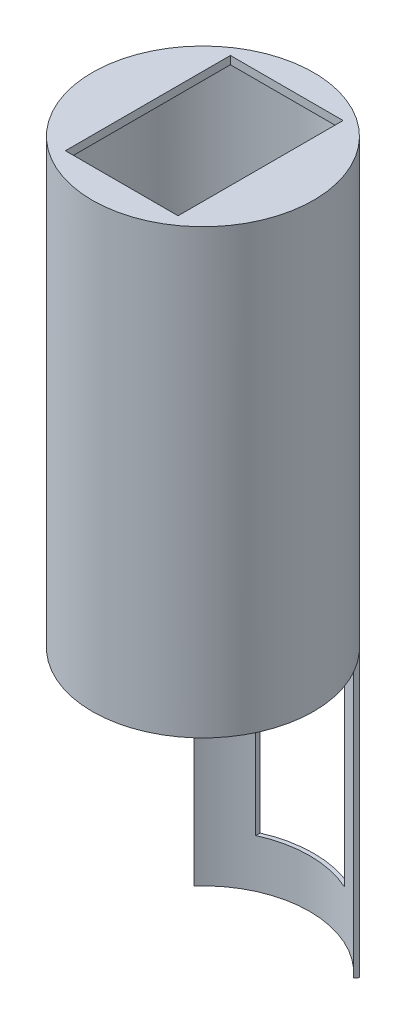
ISO-10303-21;
HEADER;
FILE_DESCRIPTION(('STEP AP214'),'2;1');
FILE_NAME('part.step','',(''),(''),'','','');
FILE_SCHEMA(('AUTOMOTIVE_DESIGN { 1 0 10303 214 1 1 1 1 }'));
ENDSEC;
DATA;
#1=APPLICATION_CONTEXT('core data for automotive mechanical design processes');
#2=APPLICATION_PROTOCOL_DEFINITION('international standard','automotive_design',2000,#1);
#3=PRODUCT_CONTEXT('',#1,'mechanical');
#4=PRODUCT('Part','Part','',(#3));
#5=PRODUCT_RELATED_PRODUCT_CATEGORY('part','',(#4));
#6=PRODUCT_DEFINITION_FORMATION('','',#4);
#7=PRODUCT_DEFINITION_CONTEXT('part definition',#1,'design');
#8=PRODUCT_DEFINITION('design','',#6,#7);
#9=PRODUCT_DEFINITION_SHAPE('','',#8);
#10=(LENGTH_UNIT() NAMED_UNIT(*) SI_UNIT(.MILLI.,.METRE.));
#11=(NAMED_UNIT(*) PLANE_ANGLE_UNIT() SI_UNIT($,.RADIAN.));
#12=(NAMED_UNIT(*) SI_UNIT($,.STERADIAN.) SOLID_ANGLE_UNIT());
#13=UNCERTAINTY_MEASURE_WITH_UNIT(LENGTH_MEASURE(1.E-05),#10,'distance_accuracy_value','');
#14=(GEOMETRIC_REPRESENTATION_CONTEXT(3) GLOBAL_UNCERTAINTY_ASSIGNED_CONTEXT((#13)) GLOBAL_UNIT_ASSIGNED_CONTEXT((#10,
#11,#12)) REPRESENTATION_CONTEXT('',''));
#15=CARTESIAN_POINT('',(0.,0.,0.));
#16=DIRECTION('',(0.,0.,1.));
#17=DIRECTION('',(1.,0.,0.));
#18=AXIS2_PLACEMENT_3D('',#15,#16,#17);
#19=CARTESIAN_POINT('',(0.,110.,0.));
#20=DIRECTION('',(0.,1.,0.));
#21=DIRECTION('',(0.,0.,1.));
#22=AXIS2_PLACEMENT_3D('',#19,#20,#21);
#23=PLANE('',#22);
#24=CARTESIAN_POINT('',(0.,110.,0.));
#25=DIRECTION('',(0.,1.,0.));
#26=DIRECTION('',(0.,0.,1.));
#27=AXIS2_PLACEMENT_3D('',#24,#25,#26);
#28=CIRCLE('',#27,27.5);
#29=CARTESIAN_POINT('',(0.,110.,27.5));
#30=VERTEX_POINT('',#29);
#31=EDGE_CURVE('E199',#30,#30,#28,.T.);
#32=ORIENTED_EDGE('',*,*,#31,.T.);
#33=EDGE_LOOP('',(#32));
#34=FACE_BOUND('',#33,.T.);
#35=DIRECTION('',(-1.,0.,0.));
#36=VECTOR('',#35,1.);
#37=CARTESIAN_POINT('',(0.,110.,20.1795265690119));
#38=LINE('',#37,#36);
#39=CARTESIAN_POINT('',(14.,110.,20.1795265690119));
#40=VERTEX_POINT('',#39);
#41=CARTESIAN_POINT('',(-14.,110.,20.1795265690119));
#42=VERTEX_POINT('',#41);
#43=EDGE_CURVE('E140',#40,#42,#38,.T.);
#44=ORIENTED_EDGE('',*,*,#43,.T.);
#45=DIRECTION('',(0.,0.,-1.));
#46=VECTOR('',#45,1.);
#47=CARTESIAN_POINT('',(-14.,110.,0.));
#48=LINE('',#47,#46);
#49=CARTESIAN_POINT('',(-14.,110.,-20.8204734309881));
#50=VERTEX_POINT('',#49);
#51=EDGE_CURVE('E134',#42,#50,#48,.T.);
#52=ORIENTED_EDGE('',*,*,#51,.T.);
#53=DIRECTION('',(1.,0.,0.));
#54=VECTOR('',#53,1.);
#55=CARTESIAN_POINT('',(0.,110.,-20.8204734309881));
#56=LINE('',#55,#54);
#57=CARTESIAN_POINT('',(14.,110.,-20.8204734309881));
#58=VERTEX_POINT('',#57);
#59=EDGE_CURVE('E123',#50,#58,#56,.T.);
#60=ORIENTED_EDGE('',*,*,#59,.T.);
#61=DIRECTION('',(0.,0.,1.));
#62=VECTOR('',#61,1.);
#63=CARTESIAN_POINT('',(14.,110.,0.));
#64=LINE('',#63,#62);
#65=EDGE_CURVE('E128',#58,#40,#64,.T.);
#66=ORIENTED_EDGE('',*,*,#65,.T.);
#67=EDGE_LOOP('',(#44,#52,#60,#66));
#68=FACE_BOUND('',#67,.T.);
#69=ADVANCED_FACE('F38',(#34,#68),#23,.T.);
#70=CARTESIAN_POINT('',(0.,108.,0.));
#71=DIRECTION('',(0.,1.,0.));
#72=DIRECTION('',(0.,0.,1.));
#73=AXIS2_PLACEMENT_3D('',#70,#71,#72);
#74=PLANE('',#73);
#75=CARTESIAN_POINT('',(0.,108.,0.));
#76=DIRECTION('',(0.,1.,0.));
#77=DIRECTION('',(0.,0.,1.));
#78=AXIS2_PLACEMENT_3D('',#75,#76,#77);
#79=CIRCLE('',#78,26.5);
#80=CARTESIAN_POINT('',(0.,108.,26.5));
#81=VERTEX_POINT('',#80);
#82=EDGE_CURVE('E186',#81,#81,#79,.T.);
#83=ORIENTED_EDGE('',*,*,#82,.F.);
#84=EDGE_LOOP('',(#83));
#85=FACE_BOUND('',#84,.T.);
#86=DIRECTION('',(0.,0.,-1.));
#87=VECTOR('',#86,1.);
#88=CARTESIAN_POINT('',(-14.,108.,0.));
#89=LINE('',#88,#87);
#90=CARTESIAN_POINT('',(-14.,108.,20.1795265690119));
#91=VERTEX_POINT('',#90);
#92=CARTESIAN_POINT('',(-14.,108.,-20.8204734309881));
#93=VERTEX_POINT('',#92);
#94=EDGE_CURVE('E11',#91,#93,#89,.T.);
#95=ORIENTED_EDGE('',*,*,#94,.F.);
#96=DIRECTION('',(-1.,0.,0.));
#97=VECTOR('',#96,1.);
#98=CARTESIAN_POINT('',(0.,108.,20.1795265690119));
#99=LINE('',#98,#97);
#100=CARTESIAN_POINT('',(14.,108.,20.1795265690119));
#101=VERTEX_POINT('',#100);
#102=EDGE_CURVE('E46',#101,#91,#99,.T.);
#103=ORIENTED_EDGE('',*,*,#102,.F.);
#104=DIRECTION('',(0.,0.,1.));
#105=VECTOR('',#104,1.);
#106=CARTESIAN_POINT('',(14.,108.,0.));
#107=LINE('',#106,#105);
#108=CARTESIAN_POINT('',(14.,108.,-20.8204734309881));
#109=VERTEX_POINT('',#108);
#110=EDGE_CURVE('E220',#109,#101,#107,.T.);
#111=ORIENTED_EDGE('',*,*,#110,.F.);
#112=DIRECTION('',(1.,0.,0.));
#113=VECTOR('',#112,1.);
#114=CARTESIAN_POINT('',(0.,108.,-20.8204734309881));
#115=LINE('',#114,#113);
#116=EDGE_CURVE('E218',#93,#109,#115,.T.);
#117=ORIENTED_EDGE('',*,*,#116,.F.);
#118=EDGE_LOOP('',(#95,#103,#111,#117));
#119=FACE_BOUND('',#118,.T.);
#120=ADVANCED_FACE('F230',(#85,#119),#74,.F.);
#121=CARTESIAN_POINT('',(0.,-70.,0.));
#122=DIRECTION('',(0.,1.,0.));
#123=DIRECTION('',(0.,0.,1.));
#124=AXIS2_PLACEMENT_3D('',#121,#122,#123);
#125=CYLINDRICAL_SURFACE('',#124,27.5);
#126=CARTESIAN_POINT('',(0.,-58.,0.));
#127=DIRECTION('',(0.,-1.,0.));
#128=DIRECTION('',(0.,0.,-1.));
#129=AXIS2_PLACEMENT_3D('',#126,#127,#128);
#130=CIRCLE('',#129,27.5);
#131=CARTESIAN_POINT('',(11.,-58.,-25.2041663222571));
#132=VERTEX_POINT('',#131);
#133=CARTESIAN_POINT('',(-11.,-58.,-25.2041663222571));
#134=VERTEX_POINT('',#133);
#135=EDGE_CURVE('E160',#132,#134,#130,.F.);
#136=ORIENTED_EDGE('',*,*,#135,.F.);
#137=DIRECTION('',(0.,1.,0.));
#138=VECTOR('',#137,1.);
#139=CARTESIAN_POINT('',(11.,-70.,-25.2041663222571));
#140=LINE('',#139,#138);
#141=CARTESIAN_POINT('',(11.,-10.,-25.2041663222571));
#142=VERTEX_POINT('',#141);
#143=EDGE_CURVE('E162',#142,#132,#140,.F.);
#144=ORIENTED_EDGE('',*,*,#143,.F.);
#145=CARTESIAN_POINT('',(0.,-10.,0.));
#146=DIRECTION('',(0.,-1.,0.));
#147=DIRECTION('',(0.,0.,-1.));
#148=AXIS2_PLACEMENT_3D('',#145,#146,#147);
#149=CIRCLE('',#148,27.5);
#150=CARTESIAN_POINT('',(-11.,-10.,-25.2041663222571));
#151=VERTEX_POINT('',#150);
#152=EDGE_CURVE('E154',#142,#151,#149,.F.);
#153=ORIENTED_EDGE('',*,*,#152,.T.);
#154=DIRECTION('',(0.,1.,0.));
#155=VECTOR('',#154,1.);
#156=CARTESIAN_POINT('',(-11.,-70.,-25.2041663222571));
#157=LINE('',#156,#155);
#158=EDGE_CURVE('E164',#134,#151,#157,.T.);
#159=ORIENTED_EDGE('',*,*,#158,.F.);
#160=EDGE_LOOP('',(#136,#144,#153,#159));
#161=FACE_BOUND('',#160,.T.);
#162=DIRECTION('',(0.,1.,0.));
#163=VECTOR('',#162,1.);
#164=CARTESIAN_POINT('',(-20.4463973813533,-70.,-18.3900743370925));
#165=LINE('',#164,#163);
#166=CARTESIAN_POINT('',(-20.4463973813533,-70.,-18.3900743370925));
#167=VERTEX_POINT('',#166);
#168=CARTESIAN_POINT('',(-20.4463973813533,0.,-18.3900743370925));
#169=VERTEX_POINT('',#168);
#170=EDGE_CURVE('E183',#167,#169,#165,.T.);
#171=ORIENTED_EDGE('',*,*,#170,.T.);
#172=CARTESIAN_POINT('',(0.,0.,0.));
#173=DIRECTION('',(0.,1.,0.));
#174=DIRECTION('',(0.,0.,1.));
#175=AXIS2_PLACEMENT_3D('',#172,#173,#174);
#176=CIRCLE('',#175,27.5);
#177=CARTESIAN_POINT('',(20.4463973813534,0.,-18.3900743370925));
#178=VERTEX_POINT('',#177);
#179=EDGE_CURVE('E167',#169,#178,#176,.T.);
#180=ORIENTED_EDGE('',*,*,#179,.T.);
#181=DIRECTION('',(0.,1.,0.));
#182=VECTOR('',#181,1.);
#183=CARTESIAN_POINT('',(20.4463973813534,-70.,-18.3900743370925));
#184=LINE('',#183,#182);
#185=CARTESIAN_POINT('',(20.4463973813534,-70.,-18.3900743370925));
#186=VERTEX_POINT('',#185);
#187=EDGE_CURVE('E175',#186,#178,#184,.T.);
#188=ORIENTED_EDGE('',*,*,#187,.F.);
#189=CARTESIAN_POINT('',(0.,-70.,0.));
#190=DIRECTION('',(0.,1.,0.));
#191=DIRECTION('',(0.,0.,1.));
#192=AXIS2_PLACEMENT_3D('',#189,#190,#191);
#193=CIRCLE('',#192,27.5);
#194=EDGE_CURVE('E202',#186,#167,#193,.T.);
#195=ORIENTED_EDGE('',*,*,#194,.T.);
#196=EDGE_LOOP('',(#171,#180,#188,#195));
#197=FACE_BOUND('',#196,.T.);
#198=ORIENTED_EDGE('',*,*,#31,.F.);
#199=EDGE_LOOP('',(#198));
#200=FACE_BOUND('',#199,.T.);
#201=ADVANCED_FACE('F40',(#161,#197,#200),#125,.T.);
#202=CARTESIAN_POINT('',(0.,-70.,0.));
#203=DIRECTION('',(0.,1.,0.));
#204=DIRECTION('',(0.,0.,1.));
#205=AXIS2_PLACEMENT_3D('',#202,#203,#204);
#206=PLANE('',#205);
#207=CARTESIAN_POINT('',(0.,-70.,0.));
#208=DIRECTION('',(0.,1.,0.));
#209=DIRECTION('',(0.,0.,1.));
#210=AXIS2_PLACEMENT_3D('',#207,#208,#209);
#211=CIRCLE('',#210,26.5);
#212=CARTESIAN_POINT('',(19.7940495323758,-70.,-17.6194665954976));
#213=VERTEX_POINT('',#212);
#214=CARTESIAN_POINT('',(-19.7940495323758,-70.,-17.6194665954976));
#215=VERTEX_POINT('',#214);
#216=EDGE_CURVE('E196',#213,#215,#211,.T.);
#217=ORIENTED_EDGE('',*,*,#216,.T.);
#218=DIRECTION('',(-0.64611257942307,0.,-0.763242120634905));
#219=VECTOR('',#218,1.);
#220=CARTESIAN_POINT('',(-20.4463973813533,-70.,-18.3900743370925));
#221=LINE('',#220,#219);
#222=EDGE_CURVE('E171',#215,#167,#221,.T.);
#223=ORIENTED_EDGE('',*,*,#222,.T.);
#224=ORIENTED_EDGE('',*,*,#194,.F.);
#225=DIRECTION('',(-0.64611257942307,0.,0.763242120634905));
#226=VECTOR('',#225,1.);
#227=CARTESIAN_POINT('',(20.4463973813534,-70.,-18.3900743370925));
#228=LINE('',#227,#226);
#229=EDGE_CURVE('E168',#186,#213,#228,.T.);
#230=ORIENTED_EDGE('',*,*,#229,.T.);
#231=EDGE_LOOP('',(#217,#223,#224,#230));
#232=FACE_BOUND('',#231,.T.);
#233=ADVANCED_FACE('F253',(#232),#206,.F.);
#234=CARTESIAN_POINT('',(0.,-70.,0.));
#235=DIRECTION('',(0.,1.,0.));
#236=DIRECTION('',(0.,0.,1.));
#237=AXIS2_PLACEMENT_3D('',#234,#235,#236);
#238=CYLINDRICAL_SURFACE('',#237,26.5);
#239=DIRECTION('',(0.,1.,0.));
#240=VECTOR('',#239,1.);
#241=CARTESIAN_POINT('',(11.,-70.,-24.1091269024824));
#242=LINE('',#241,#240);
#243=CARTESIAN_POINT('',(11.,-10.,-24.1091269024824));
#244=VERTEX_POINT('',#243);
#245=CARTESIAN_POINT('',(11.,-58.,-24.1091269024824));
#246=VERTEX_POINT('',#245);
#247=EDGE_CURVE('E209',#244,#246,#242,.F.);
#248=ORIENTED_EDGE('',*,*,#247,.T.);
#249=CARTESIAN_POINT('',(0.,-58.,0.));
#250=DIRECTION('',(0.,-1.,0.));
#251=DIRECTION('',(0.,0.,-1.));
#252=AXIS2_PLACEMENT_3D('',#249,#250,#251);
#253=CIRCLE('',#252,26.5);
#254=CARTESIAN_POINT('',(-11.,-58.,-24.1091269024824));
#255=VERTEX_POINT('',#254);
#256=EDGE_CURVE('E215',#246,#255,#253,.F.);
#257=ORIENTED_EDGE('',*,*,#256,.T.);
#258=DIRECTION('',(0.,1.,0.));
#259=VECTOR('',#258,1.);
#260=CARTESIAN_POINT('',(-11.,-70.,-24.1091269024824));
#261=LINE('',#260,#259);
#262=CARTESIAN_POINT('',(-11.,-10.,-24.1091269024824));
#263=VERTEX_POINT('',#262);
#264=EDGE_CURVE('E212',#255,#263,#261,.T.);
#265=ORIENTED_EDGE('',*,*,#264,.T.);
#266=CARTESIAN_POINT('',(0.,-10.,0.));
#267=DIRECTION('',(0.,-1.,0.));
#268=DIRECTION('',(0.,0.,-1.));
#269=AXIS2_PLACEMENT_3D('',#266,#267,#268);
#270=CIRCLE('',#269,26.5);
#271=EDGE_CURVE('E207',#244,#263,#270,.F.);
#272=ORIENTED_EDGE('',*,*,#271,.F.);
#273=EDGE_LOOP('',(#248,#257,#265,#272));
#274=FACE_BOUND('',#273,.T.);
#275=CARTESIAN_POINT('',(0.,0.,0.));
#276=DIRECTION('',(0.,-1.,0.));
#277=DIRECTION('',(0.,0.,-1.));
#278=AXIS2_PLACEMENT_3D('',#275,#276,#277);
#279=CIRCLE('',#278,26.5);
#280=CARTESIAN_POINT('',(-19.7940495323758,0.,-17.6194665954976));
#281=VERTEX_POINT('',#280);
#282=CARTESIAN_POINT('',(19.7940495323758,0.,-17.6194665954976));
#283=VERTEX_POINT('',#282);
#284=EDGE_CURVE('E205',#281,#283,#279,.F.);
#285=ORIENTED_EDGE('',*,*,#284,.F.);
#286=DIRECTION('',(0.,1.,0.));
#287=VECTOR('',#286,1.);
#288=CARTESIAN_POINT('',(-19.7940495323758,-70.,-17.6194665954976));
#289=LINE('',#288,#287);
#290=EDGE_CURVE('E187',#215,#281,#289,.T.);
#291=ORIENTED_EDGE('',*,*,#290,.F.);
#292=ORIENTED_EDGE('',*,*,#216,.F.);
#293=DIRECTION('',(0.,1.,0.));
#294=VECTOR('',#293,1.);
#295=CARTESIAN_POINT('',(19.7940495323758,-70.,-17.6194665954976));
#296=LINE('',#295,#294);
#297=EDGE_CURVE('E190',#213,#283,#296,.T.);
#298=ORIENTED_EDGE('',*,*,#297,.T.);
#299=EDGE_LOOP('',(#285,#291,#292,#298));
#300=FACE_BOUND('',#299,.T.);
#301=ORIENTED_EDGE('',*,*,#82,.T.);
#302=EDGE_LOOP('',(#301));
#303=FACE_BOUND('',#302,.T.);
#304=ADVANCED_FACE('F252',(#274,#300,#303),#238,.F.);
#305=CARTESIAN_POINT('',(0.,0.,0.));
#306=DIRECTION('',(0.,-1.,0.));
#307=DIRECTION('',(0.,0.,-1.));
#308=AXIS2_PLACEMENT_3D('',#305,#306,#307);
#309=PLANE('',#308);
#310=ORIENTED_EDGE('',*,*,#284,.T.);
#311=DIRECTION('',(-0.64611257942307,0.,0.763242120634905));
#312=VECTOR('',#311,1.);
#313=CARTESIAN_POINT('',(20.4463973813534,0.,-18.3900743370925));
#314=LINE('',#313,#312);
#315=EDGE_CURVE('E178',#178,#283,#314,.T.);
#316=ORIENTED_EDGE('',*,*,#315,.F.);
#317=ORIENTED_EDGE('',*,*,#179,.F.);
#318=DIRECTION('',(-0.64611257942307,0.,-0.763242120634905));
#319=VECTOR('',#318,1.);
#320=CARTESIAN_POINT('',(-20.4463973813533,0.,-18.3900743370925));
#321=LINE('',#320,#319);
#322=EDGE_CURVE('E172',#281,#169,#321,.T.);
#323=ORIENTED_EDGE('',*,*,#322,.F.);
#324=EDGE_LOOP('',(#310,#316,#317,#323));
#325=FACE_BOUND('',#324,.T.);
#326=ADVANCED_FACE('F260',(#325),#309,.T.);
#327=CARTESIAN_POINT('',(-20.4463973813533,-70.,-18.3900743370925));
#328=DIRECTION('',(0.763242120634905,0.,-0.64611257942307));
#329=DIRECTION('',(-0.64611257942307,0.,-0.763242120634905));
#330=AXIS2_PLACEMENT_3D('',#327,#328,#329);
#331=PLANE('',#330);
#332=ORIENTED_EDGE('',*,*,#322,.T.);
#333=ORIENTED_EDGE('',*,*,#170,.F.);
#334=ORIENTED_EDGE('',*,*,#222,.F.);
#335=ORIENTED_EDGE('',*,*,#290,.T.);
#336=EDGE_LOOP('',(#332,#333,#334,#335));
#337=FACE_BOUND('',#336,.T.);
#338=ADVANCED_FACE('F270',(#337),#331,.F.);
#339=CARTESIAN_POINT('',(20.4463973813534,-70.,-18.3900743370925));
#340=DIRECTION('',(-0.763242120634905,0.,-0.64611257942307));
#341=DIRECTION('',(-0.64611257942307,0.,0.763242120634905));
#342=AXIS2_PLACEMENT_3D('',#339,#340,#341);
#343=PLANE('',#342);
#344=ORIENTED_EDGE('',*,*,#315,.T.);
#345=ORIENTED_EDGE('',*,*,#297,.F.);
#346=ORIENTED_EDGE('',*,*,#229,.F.);
#347=ORIENTED_EDGE('',*,*,#187,.T.);
#348=EDGE_LOOP('',(#344,#345,#346,#347));
#349=FACE_BOUND('',#348,.T.);
#350=ADVANCED_FACE('F277',(#349),#343,.F.);
#351=CARTESIAN_POINT('',(-11.,-58.,-17.9106241321993));
#352=DIRECTION('',(-1.,0.,0.));
#353=DIRECTION('',(0.,0.,1.));
#354=AXIS2_PLACEMENT_3D('',#351,#352,#353);
#355=PLANE('',#354);
#356=ORIENTED_EDGE('',*,*,#158,.T.);
#357=DIRECTION('',(0.,0.,1.));
#358=VECTOR('',#357,1.);
#359=CARTESIAN_POINT('',(-11.,-10.,-17.9106241321993));
#360=LINE('',#359,#358);
#361=EDGE_CURVE('E141',#151,#263,#360,.T.);
#362=ORIENTED_EDGE('',*,*,#361,.T.);
#363=ORIENTED_EDGE('',*,*,#264,.F.);
#364=DIRECTION('',(0.,0.,1.));
#365=VECTOR('',#364,1.);
#366=CARTESIAN_POINT('',(-11.,-58.,-17.9106241321993));
#367=LINE('',#366,#365);
#368=EDGE_CURVE('E149',#134,#255,#367,.T.);
#369=ORIENTED_EDGE('',*,*,#368,.F.);
#370=EDGE_LOOP('',(#356,#362,#363,#369));
#371=FACE_BOUND('',#370,.T.);
#372=ADVANCED_FACE('F279',(#371),#355,.F.);
#373=CARTESIAN_POINT('',(11.,-58.,-17.9106241321993));
#374=DIRECTION('',(1.,0.,0.));
#375=DIRECTION('',(0.,0.,-1.));
#376=AXIS2_PLACEMENT_3D('',#373,#374,#375);
#377=PLANE('',#376);
#378=ORIENTED_EDGE('',*,*,#143,.T.);
#379=DIRECTION('',(0.,0.,-1.));
#380=VECTOR('',#379,1.);
#381=CARTESIAN_POINT('',(11.,-58.,-17.9106241321993));
#382=LINE('',#381,#380);
#383=EDGE_CURVE('E152',#246,#132,#382,.T.);
#384=ORIENTED_EDGE('',*,*,#383,.F.);
#385=ORIENTED_EDGE('',*,*,#247,.F.);
#386=DIRECTION('',(0.,0.,-1.));
#387=VECTOR('',#386,1.);
#388=CARTESIAN_POINT('',(11.,-10.,-17.9106241321993));
#389=LINE('',#388,#387);
#390=EDGE_CURVE('E144',#244,#142,#389,.T.);
#391=ORIENTED_EDGE('',*,*,#390,.T.);
#392=EDGE_LOOP('',(#378,#384,#385,#391));
#393=FACE_BOUND('',#392,.T.);
#394=ADVANCED_FACE('F285',(#393),#377,.F.);
#395=CARTESIAN_POINT('',(0.,-58.,0.));
#396=DIRECTION('',(0.,-1.,0.));
#397=DIRECTION('',(0.,0.,-1.));
#398=AXIS2_PLACEMENT_3D('',#395,#396,#397);
#399=PLANE('',#398);
#400=ORIENTED_EDGE('',*,*,#135,.T.);
#401=ORIENTED_EDGE('',*,*,#368,.T.);
#402=ORIENTED_EDGE('',*,*,#256,.F.);
#403=ORIENTED_EDGE('',*,*,#383,.T.);
#404=EDGE_LOOP('',(#400,#401,#402,#403));
#405=FACE_BOUND('',#404,.T.);
#406=ADVANCED_FACE('F294',(#405),#399,.F.);
#407=CARTESIAN_POINT('',(0.,-10.,0.));
#408=DIRECTION('',(0.,-1.,0.));
#409=DIRECTION('',(0.,0.,-1.));
#410=AXIS2_PLACEMENT_3D('',#407,#408,#409);
#411=PLANE('',#410);
#412=ORIENTED_EDGE('',*,*,#390,.F.);
#413=ORIENTED_EDGE('',*,*,#271,.T.);
#414=ORIENTED_EDGE('',*,*,#361,.F.);
#415=ORIENTED_EDGE('',*,*,#152,.F.);
#416=EDGE_LOOP('',(#412,#413,#414,#415));
#417=FACE_BOUND('',#416,.T.);
#418=ADVANCED_FACE('F296',(#417),#411,.T.);
#419=CARTESIAN_POINT('',(-14.,119.,-20.8204734309881));
#420=DIRECTION('',(1.,0.,0.));
#421=DIRECTION('',(0.,0.,-1.));
#422=AXIS2_PLACEMENT_3D('',#419,#420,#421);
#423=PLANE('',#422);
#424=DIRECTION('',(0.,-1.,0.));
#425=VECTOR('',#424,1.);
#426=CARTESIAN_POINT('',(-14.,119.,20.1795265690119));
#427=LINE('',#426,#425);
#428=EDGE_CURVE('E129',#42,#91,#427,.T.);
#429=ORIENTED_EDGE('',*,*,#428,.T.);
#430=ORIENTED_EDGE('',*,*,#94,.T.);
#431=DIRECTION('',(0.,-1.,0.));
#432=VECTOR('',#431,1.);
#433=CARTESIAN_POINT('',(-14.,119.,-20.8204734309881));
#434=LINE('',#433,#432);
#435=EDGE_CURVE('E58',#50,#93,#434,.T.);
#436=ORIENTED_EDGE('',*,*,#435,.F.);
#437=ORIENTED_EDGE('',*,*,#51,.F.);
#438=EDGE_LOOP('',(#429,#430,#436,#437));
#439=FACE_BOUND('',#438,.T.);
#440=ADVANCED_FACE('F133',(#439),#423,.T.);
#441=CARTESIAN_POINT('',(-14.,119.,20.1795265690119));
#442=DIRECTION('',(0.,0.,-1.));
#443=DIRECTION('',(-1.,0.,0.));
#444=AXIS2_PLACEMENT_3D('',#441,#442,#443);
#445=PLANE('',#444);
#446=DIRECTION('',(0.,-1.,0.));
#447=VECTOR('',#446,1.);
#448=CARTESIAN_POINT('',(14.,119.,20.1795265690119));
#449=LINE('',#448,#447);
#450=EDGE_CURVE('E226',#40,#101,#449,.T.);
#451=ORIENTED_EDGE('',*,*,#450,.T.);
#452=ORIENTED_EDGE('',*,*,#102,.T.);
#453=ORIENTED_EDGE('',*,*,#428,.F.);
#454=ORIENTED_EDGE('',*,*,#43,.F.);
#455=EDGE_LOOP('',(#451,#452,#453,#454));
#456=FACE_BOUND('',#455,.T.);
#457=ADVANCED_FACE('F224',(#456),#445,.T.);
#458=CARTESIAN_POINT('',(14.,119.,-20.8204734309881));
#459=DIRECTION('',(-1.,0.,0.));
#460=DIRECTION('',(0.,0.,1.));
#461=AXIS2_PLACEMENT_3D('',#458,#459,#460);
#462=PLANE('',#461);
#463=DIRECTION('',(0.,-1.,0.));
#464=VECTOR('',#463,1.);
#465=CARTESIAN_POINT('',(14.,119.,-20.8204734309881));
#466=LINE('',#465,#464);
#467=EDGE_CURVE('E53',#58,#109,#466,.T.);
#468=ORIENTED_EDGE('',*,*,#467,.T.);
#469=ORIENTED_EDGE('',*,*,#110,.T.);
#470=ORIENTED_EDGE('',*,*,#450,.F.);
#471=ORIENTED_EDGE('',*,*,#65,.F.);
#472=EDGE_LOOP('',(#468,#469,#470,#471));
#473=FACE_BOUND('',#472,.T.);
#474=ADVANCED_FACE('F232',(#473),#462,.T.);
#475=CARTESIAN_POINT('',(14.,119.,-20.8204734309881));
#476=DIRECTION('',(0.,0.,1.));
#477=DIRECTION('',(1.,0.,0.));
#478=AXIS2_PLACEMENT_3D('',#475,#476,#477);
#479=PLANE('',#478);
#480=ORIENTED_EDGE('',*,*,#435,.T.);
#481=ORIENTED_EDGE('',*,*,#116,.T.);
#482=ORIENTED_EDGE('',*,*,#467,.F.);
#483=ORIENTED_EDGE('',*,*,#59,.F.);
#484=EDGE_LOOP('',(#480,#481,#482,#483));
#485=FACE_BOUND('',#484,.T.);
#486=ADVANCED_FACE('F124',(#485),#479,.T.);
#487=CLOSED_SHELL('',(#69,#120,#201,#233,#304,#326,#338,#350,#372,#394,#406,#418,#440,#457,#474,#486));
#488=MANIFOLD_SOLID_BREP('B2',#487);
#489=ADVANCED_BREP_SHAPE_REPRESENTATION('',(#18,#488),#14);
#490=SHAPE_DEFINITION_REPRESENTATION(#9,#489);
ENDSEC;
END-ISO-10303-21;
